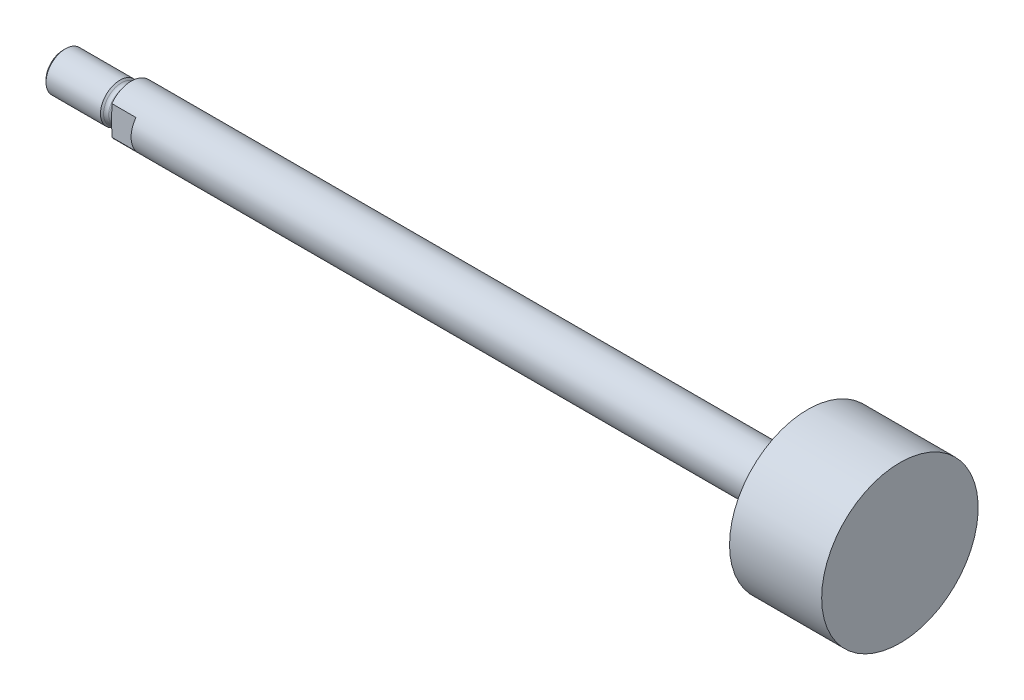
ISO-10303-21;
HEADER;
FILE_DESCRIPTION(('STEP AP214'),'2;1');
FILE_NAME('part.step','',(''),(''),'','','');
FILE_SCHEMA(('AUTOMOTIVE_DESIGN { 1 0 10303 214 1 1 1 1 }'));
ENDSEC;
DATA;
#1=APPLICATION_CONTEXT('core data for automotive mechanical design processes');
#2=APPLICATION_PROTOCOL_DEFINITION('international standard','automotive_design',2000,#1);
#3=PRODUCT_CONTEXT('',#1,'mechanical');
#4=PRODUCT('Part','Part','',(#3));
#5=PRODUCT_RELATED_PRODUCT_CATEGORY('part','',(#4));
#6=PRODUCT_DEFINITION_FORMATION('','',#4);
#7=PRODUCT_DEFINITION_CONTEXT('part definition',#1,'design');
#8=PRODUCT_DEFINITION('design','',#6,#7);
#9=PRODUCT_DEFINITION_SHAPE('','',#8);
#10=(LENGTH_UNIT() NAMED_UNIT(*) SI_UNIT(.MILLI.,.METRE.));
#11=(NAMED_UNIT(*) PLANE_ANGLE_UNIT() SI_UNIT($,.RADIAN.));
#12=(NAMED_UNIT(*) SI_UNIT($,.STERADIAN.) SOLID_ANGLE_UNIT());
#13=UNCERTAINTY_MEASURE_WITH_UNIT(LENGTH_MEASURE(1.E-05),#10,'distance_accuracy_value','');
#14=(GEOMETRIC_REPRESENTATION_CONTEXT(3) GLOBAL_UNCERTAINTY_ASSIGNED_CONTEXT((#13)) GLOBAL_UNIT_ASSIGNED_CONTEXT((#10,
#11,#12)) REPRESENTATION_CONTEXT('',''));
#15=CARTESIAN_POINT('',(0.,0.,0.));
#16=DIRECTION('',(0.,0.,1.));
#17=DIRECTION('',(1.,0.,0.));
#18=AXIS2_PLACEMENT_3D('',#15,#16,#17);
#19=CARTESIAN_POINT('',(-31.75,0.,0.));
#20=DIRECTION('',(1.,0.,0.));
#21=DIRECTION('',(0.,0.,-1.));
#22=AXIS2_PLACEMENT_3D('',#19,#20,#21);
#23=PLANE('',#22);
#24=CARTESIAN_POINT('',(-31.7499999999882,0.,0.));
#25=DIRECTION('',(1.,0.,0.));
#26=DIRECTION('',(0.,1.,0.));
#27=AXIS2_PLACEMENT_3D('',#24,#25,#26);
#28=CIRCLE('',#27,5.59435000002395);
#29=CARTESIAN_POINT('',(-31.7499999999882,5.59435000002395,0.));
#30=VERTEX_POINT('',#29);
#31=EDGE_CURVE('E19',#30,#30,#28,.T.);
#32=ORIENTED_EDGE('',*,*,#31,.F.);
#33=EDGE_LOOP('',(#32));
#34=FACE_BOUND('',#33,.T.);
#35=ADVANCED_FACE('F16',(#34),#23,.F.);
#36=CARTESIAN_POINT('',(-30.9943500001282,0.,0.));
#37=DIRECTION('',(1.,0.,0.));
#38=DIRECTION('',(0.,1.,0.));
#39=AXIS2_PLACEMENT_3D('',#36,#37,#38);
#40=CONICAL_SURFACE('',#39,6.34999999988395,0.785398163397448);
#41=ORIENTED_EDGE('',*,*,#31,.T.);
#42=EDGE_LOOP('',(#41));
#43=FACE_BOUND('',#42,.T.);
#44=CARTESIAN_POINT('',(-30.99435,0.,0.));
#45=DIRECTION('',(-1.,0.,0.));
#46=DIRECTION('',(0.,0.,1.));
#47=AXIS2_PLACEMENT_3D('',#44,#45,#46);
#48=CIRCLE('',#47,6.35);
#49=CARTESIAN_POINT('',(-30.99435,0.,6.35));
#50=VERTEX_POINT('',#49);
#51=EDGE_CURVE('E178',#50,#50,#48,.F.);
#52=ORIENTED_EDGE('',*,*,#51,.F.);
#53=EDGE_LOOP('',(#52));
#54=FACE_BOUND('',#53,.T.);
#55=ADVANCED_FACE('F210',(#43,#54),#40,.T.);
#56=CARTESIAN_POINT('',(-9.525,0.,0.));
#57=DIRECTION('',(-1.,0.,0.));
#58=DIRECTION('',(0.,0.,1.));
#59=AXIS2_PLACEMENT_3D('',#56,#57,#58);
#60=CYLINDRICAL_SURFACE('',#59,6.35);
#61=ORIENTED_EDGE('',*,*,#51,.T.);
#62=EDGE_LOOP('',(#61));
#63=FACE_BOUND('',#62,.T.);
#64=CARTESIAN_POINT('',(-13.2333999999901,0.,0.));
#65=DIRECTION('',(-1.,0.,0.));
#66=DIRECTION('',(0.,0.,1.));
#67=AXIS2_PLACEMENT_3D('',#64,#65,#66);
#68=CIRCLE('',#67,6.34999999999764);
#69=CARTESIAN_POINT('',(-13.2333999999901,0.,6.34999999999764));
#70=VERTEX_POINT('',#69);
#71=EDGE_CURVE('E181',#70,#70,#68,.F.);
#72=ORIENTED_EDGE('',*,*,#71,.F.);
#73=EDGE_LOOP('',(#72));
#74=FACE_BOUND('',#73,.T.);
#75=ADVANCED_FACE('F207',(#63,#74),#60,.T.);
#76=CARTESIAN_POINT('',(-13.2333999998764,0.,0.));
#77=DIRECTION('',(-1.,0.,0.));
#78=DIRECTION('',(0.,0.,1.));
#79=AXIS2_PLACEMENT_3D('',#76,#77,#78);
#80=CONICAL_SURFACE('',#79,6.34999999994079,0.785398163453503);
#81=ORIENTED_EDGE('',*,*,#71,.T.);
#82=EDGE_LOOP('',(#81));
#83=FACE_BOUND('',#82,.T.);
#84=CARTESIAN_POINT('',(-12.726366704261,0.,0.));
#85=DIRECTION('',(1.,0.,0.));
#86=DIRECTION('',(0.,0.,-1.));
#87=AXIS2_PLACEMENT_3D('',#84,#85,#86);
#88=CIRCLE('',#87,5.84296670426099);
#89=CARTESIAN_POINT('',(-12.726366704261,0.,-5.84296670426099));
#90=VERTEX_POINT('',#89);
#91=EDGE_CURVE('E186',#90,#90,#88,.F.);
#92=ORIENTED_EDGE('',*,*,#91,.T.);
#93=EDGE_LOOP('',(#92));
#94=FACE_BOUND('',#93,.T.);
#95=ADVANCED_FACE('F202',(#83,#94),#80,.T.);
#96=CARTESIAN_POINT('',(-11.558933408522,0.,0.));
#97=DIRECTION('',(1.,0.,0.));
#98=DIRECTION('',(0.,0.,-1.));
#99=AXIS2_PLACEMENT_3D('',#96,#97,#98);
#100=TOROIDAL_SURFACE('',#99,7.0104,1.65100000000001);
#101=ORIENTED_EDGE('',*,*,#91,.F.);
#102=EDGE_LOOP('',(#101));
#103=FACE_BOUND('',#102,.T.);
#104=CARTESIAN_POINT('',(-11.558933408522,0.,0.));
#105=DIRECTION('',(-1.,0.,0.));
#106=DIRECTION('',(0.,0.,1.));
#107=AXIS2_PLACEMENT_3D('',#104,#105,#106);
#108=CIRCLE('',#107,5.3594);
#109=CARTESIAN_POINT('',(-11.558933408522,0.,5.3594));
#110=VERTEX_POINT('',#109);
#111=EDGE_CURVE('E191',#110,#110,#108,.F.);
#112=ORIENTED_EDGE('',*,*,#111,.F.);
#113=EDGE_LOOP('',(#112));
#114=FACE_BOUND('',#113,.T.);
#115=ADVANCED_FACE('F197',(#103,#114),#100,.F.);
#116=CARTESIAN_POINT('',(241.173,25.52065,0.));
#117=DIRECTION('',(-1.,0.,0.));
#118=DIRECTION('',(0.,0.,1.));
#119=AXIS2_PLACEMENT_3D('',#116,#117,#118);
#120=PLANE('',#119);
#121=CARTESIAN_POINT('',(241.173,0.,0.));
#122=DIRECTION('',(-1.,0.,0.));
#123=DIRECTION('',(0.,0.,1.));
#124=AXIS2_PLACEMENT_3D('',#121,#122,#123);
#125=CIRCLE('',#124,25.52065);
#126=CARTESIAN_POINT('',(241.173,0.,25.52065));
#127=VERTEX_POINT('',#126);
#128=EDGE_CURVE('E386',#127,#127,#125,.T.);
#129=ORIENTED_EDGE('',*,*,#128,.F.);
#130=EDGE_LOOP('',(#129));
#131=FACE_BOUND('',#130,.T.);
#132=ADVANCED_FACE('F201',(#131),#120,.F.);
#133=CARTESIAN_POINT('',(-9.525,0.,0.));
#134=DIRECTION('',(-1.,0.,0.));
#135=DIRECTION('',(0.,0.,1.));
#136=AXIS2_PLACEMENT_3D('',#133,#134,#135);
#137=CYLINDRICAL_SURFACE('',#136,5.3594);
#138=ORIENTED_EDGE('',*,*,#111,.T.);
#139=EDGE_LOOP('',(#138));
#140=FACE_BOUND('',#139,.T.);
#141=CARTESIAN_POINT('',(-11.176,0.,0.));
#142=DIRECTION('',(1.,0.,0.));
#143=DIRECTION('',(0.,0.,-1.));
#144=AXIS2_PLACEMENT_3D('',#141,#142,#143);
#145=CIRCLE('',#144,5.3594);
#146=CARTESIAN_POINT('',(-11.176,0.,-5.3594));
#147=VERTEX_POINT('',#146);
#148=EDGE_CURVE('E388',#147,#147,#145,.F.);
#149=ORIENTED_EDGE('',*,*,#148,.T.);
#150=EDGE_LOOP('',(#149));
#151=FACE_BOUND('',#150,.T.);
#152=ADVANCED_FACE('F276',(#140,#151),#137,.T.);
#153=CARTESIAN_POINT('',(241.173,0.,0.));
#154=DIRECTION('',(-1.,0.,0.));
#155=DIRECTION('',(0.,0.,1.));
#156=AXIS2_PLACEMENT_3D('',#153,#154,#155);
#157=CYLINDRICAL_SURFACE('',#156,25.52065);
#158=CARTESIAN_POINT('',(211.1248,0.,0.));
#159=DIRECTION('',(-1.,0.,0.));
#160=DIRECTION('',(0.,0.,1.));
#161=AXIS2_PLACEMENT_3D('',#158,#159,#160);
#162=CIRCLE('',#161,25.52065);
#163=CARTESIAN_POINT('',(211.1248,0.,25.52065));
#164=VERTEX_POINT('',#163);
#165=EDGE_CURVE('E90',#164,#164,#162,.F.);
#166=ORIENTED_EDGE('',*,*,#165,.T.);
#167=EDGE_LOOP('',(#166));
#168=FACE_BOUND('',#167,.T.);
#169=ORIENTED_EDGE('',*,*,#128,.T.);
#170=EDGE_LOOP('',(#169));
#171=FACE_BOUND('',#170,.T.);
#172=ADVANCED_FACE('F269',(#168,#171),#157,.T.);
#173=CARTESIAN_POINT('',(-11.176,0.,0.));
#174=DIRECTION('',(1.,0.,0.));
#175=DIRECTION('',(0.,0.,-1.));
#176=AXIS2_PLACEMENT_3D('',#173,#174,#175);
#177=TOROIDAL_SURFACE('',#176,7.0104,1.651);
#178=ORIENTED_EDGE('',*,*,#148,.F.);
#179=EDGE_LOOP('',(#178));
#180=FACE_BOUND('',#179,.T.);
#181=CARTESIAN_POINT('',(-9.525,2.97038855370801,-6.35));
#182=CARTESIAN_POINT('',(-9.52500432717314,2.87856001304067,-6.35));
#183=CARTESIAN_POINT('',(-9.52637466481895,2.78674691580267,-6.35));
#184=CARTESIAN_POINT('',(-9.53125694264594,2.60320136632233,-6.35));
#185=CARTESIAN_POINT('',(-9.53476827720515,2.51146889861821,-6.35));
#186=CARTESIAN_POINT('',(-9.54764417214961,2.23608737385469,-6.35));
#187=CARTESIAN_POINT('',(-9.55934673670103,2.05255650770518,-6.35));
#188=CARTESIAN_POINT('',(-9.5846169660275,1.68545441374015,-6.35));
#189=CARTESIAN_POINT('',(-9.59818655095662,1.50188334117978,-6.35));
#190=CARTESIAN_POINT('',(-9.62318520155134,1.13501829903267,-6.35));
#191=CARTESIAN_POINT('',(-9.63461933357041,0.951724723885822,-6.35));
#192=CARTESIAN_POINT('',(-9.64786787115241,0.676684464035815,-6.35));
#193=CARTESIAN_POINT('',(-9.65163267642366,0.585034676844251,-6.35));
#194=CARTESIAN_POINT('',(-9.65761687588684,0.401685560228313,-6.35));
#195=CARTESIAN_POINT('',(-9.65983630232245,0.309986231877548,-6.35));
#196=CARTESIAN_POINT('',(-9.66256716675136,0.12663024456845,-6.35));
#197=CARTESIAN_POINT('',(-9.66307988474391,0.0349736052032149,-6.35));
#198=CARTESIAN_POINT('',(-9.66236638328493,-0.148332071725467,-6.35));
#199=CARTESIAN_POINT('',(-9.66114017346013,-0.239981109328187,-6.35000000000001));
#200=CARTESIAN_POINT('',(-9.65662353619468,-0.441500345888313,-6.35000000000002));
#201=CARTESIAN_POINT('',(-9.65297047367083,-0.551362349619012,-6.35));
#202=CARTESIAN_POINT('',(-9.64364720433923,-0.771058786420898,-6.35));
#203=CARTESIAN_POINT('',(-9.63797587423027,-0.88089316998469,-6.35));
#204=CARTESIAN_POINT('',(-9.62518265463312,-1.10053620189394,-6.35));
#205=CARTESIAN_POINT('',(-9.61805995669679,-1.2103448015983,-6.35));
#206=CARTESIAN_POINT('',(-9.60308054190903,-1.42994756441094,-6.35));
#207=CARTESIAN_POINT('',(-9.59522357647099,-1.53974170993603,-6.35));
#208=CARTESIAN_POINT('',(-9.57958178368191,-1.75953919720968,-6.35));
#209=CARTESIAN_POINT('',(-9.57179711614879,-1.86954255122618,-6.35));
#210=CARTESIAN_POINT('',(-9.55720939085882,-2.08957585527725,-6.35));
#211=CARTESIAN_POINT('',(-9.55040597696202,-2.19960578107058,-6.35));
#212=CARTESIAN_POINT('',(-9.53871837056633,-2.41972206498445,-6.35));
#213=CARTESIAN_POINT('',(-9.53383322860493,-2.52980836811447,-6.35));
#214=CARTESIAN_POINT('',(-9.52697965054751,-2.75004901434376,-6.35));
#215=CARTESIAN_POINT('',(-9.52501073020114,-2.86020334310726,-6.35));
#216=CARTESIAN_POINT('',(-9.525,-2.97038855370809,-6.35));
#217=B_SPLINE_CURVE_WITH_KNOTS('',3,(#181,#182,#183,#184,#185,#186,#187,#188,#189,#190,#191,
#192,#193,#194,#195,#196,#197,#198,#199,#200,#201,#202,#203,#204,#205,#206,#207,#208,#209,#210,
#211,#212,#213,#214,#215,#216),.UNSPECIFIED.,.F.,.F.,(4,2,2,2,2,2,2,2,2,2,2,2,2,2,2,2,2,4),(0.,
0.275453824117417,0.550829766971975,1.10248801480419,1.65471792159181,2.20562054264102,
2.48079023089343,2.75595417767494,3.03091171012026,3.30586772040328,3.63561237057661,
3.96554083351519,4.29565357971293,4.62587849341643,4.95671259976355,5.28742632811416,
5.61797616036996,5.94847109733863),.UNSPECIFIED.);
#218=CARTESIAN_POINT('',(-9.52499999999963,2.97038855370801,-6.35));
#219=VERTEX_POINT('',#218);
#220=CARTESIAN_POINT('',(-9.525,-2.97038855370809,-6.34999999999999));
#221=VERTEX_POINT('',#220);
#222=EDGE_CURVE('E65',#219,#221,#217,.T.);
#223=ORIENTED_EDGE('',*,*,#222,.T.);
#224=CARTESIAN_POINT('',(-9.525,0.,0.));
#225=DIRECTION('',(-1.,0.,0.));
#226=DIRECTION('',(0.,-0.423711707421558,-0.905797101449275));
#227=AXIS2_PLACEMENT_3D('',#224,#225,#226);
#228=CIRCLE('',#227,7.01039999999997);
#229=CARTESIAN_POINT('',(-9.52499999999982,-2.97038855370801,6.35));
#230=VERTEX_POINT('',#229);
#231=EDGE_CURVE('E78',#221,#230,#228,.T.);
#232=ORIENTED_EDGE('',*,*,#231,.T.);
#233=CARTESIAN_POINT('',(-9.525,-2.97038855370801,6.35));
#234=CARTESIAN_POINT('',(-9.52500432717314,-2.87856001304066,6.35));
#235=CARTESIAN_POINT('',(-9.52637466481895,-2.78674691580267,6.35));
#236=CARTESIAN_POINT('',(-9.53125694264594,-2.60320136632233,6.35));
#237=CARTESIAN_POINT('',(-9.53476827720515,-2.5114688986182,6.35));
#238=CARTESIAN_POINT('',(-9.54764417214961,-2.23608737385469,6.35));
#239=CARTESIAN_POINT('',(-9.55934673670103,-2.05255650770518,6.35));
#240=CARTESIAN_POINT('',(-9.5846169660275,-1.68545441374014,6.35));
#241=CARTESIAN_POINT('',(-9.59818655095662,-1.50188334117978,6.35));
#242=CARTESIAN_POINT('',(-9.62318520155134,-1.13501829903267,6.35));
#243=CARTESIAN_POINT('',(-9.63461933357041,-0.951724723885818,6.35));
#244=CARTESIAN_POINT('',(-9.64786787115241,-0.676684464035811,6.35));
#245=CARTESIAN_POINT('',(-9.65163267642366,-0.585034676844247,6.35));
#246=CARTESIAN_POINT('',(-9.65761687588684,-0.401685560228309,6.35));
#247=CARTESIAN_POINT('',(-9.65983630232245,-0.309986231877544,6.35));
#248=CARTESIAN_POINT('',(-9.66256716675136,-0.126630244568446,6.35));
#249=CARTESIAN_POINT('',(-9.66307988474391,-0.0349736052032102,6.35));
#250=CARTESIAN_POINT('',(-9.66236638328493,0.148332071725471,6.35));
#251=CARTESIAN_POINT('',(-9.66114017346013,0.239981109328192,6.35000000000002));
#252=CARTESIAN_POINT('',(-9.65662353619468,0.441500345888318,6.35000000000002));
#253=CARTESIAN_POINT('',(-9.65297047367083,0.551362349619017,6.35));
#254=CARTESIAN_POINT('',(-9.64364720433923,0.771058786420902,6.34999999999999));
#255=CARTESIAN_POINT('',(-9.63797587423028,0.880893169984694,6.35));
#256=CARTESIAN_POINT('',(-9.62518265463312,1.10053620189394,6.35));
#257=CARTESIAN_POINT('',(-9.61805995669679,1.2103448015983,6.35));
#258=CARTESIAN_POINT('',(-9.60308054190903,1.42994756441094,6.35));
#259=CARTESIAN_POINT('',(-9.595223576471,1.53974170993603,6.35));
#260=CARTESIAN_POINT('',(-9.57958178368191,1.75953919720968,6.35));
#261=CARTESIAN_POINT('',(-9.57179711614879,1.86954255122618,6.35));
#262=CARTESIAN_POINT('',(-9.55720939085882,2.08957585527725,6.35));
#263=CARTESIAN_POINT('',(-9.55040597696202,2.19960578107058,6.35));
#264=CARTESIAN_POINT('',(-9.53871837056633,2.41972206498445,6.35));
#265=CARTESIAN_POINT('',(-9.53383322860493,2.52980836811447,6.35));
#266=CARTESIAN_POINT('',(-9.52697965054751,2.75004901434376,6.35));
#267=CARTESIAN_POINT('',(-9.52501073020114,2.86020334310726,6.35));
#268=CARTESIAN_POINT('',(-9.525,2.97038855370809,6.35));
#269=B_SPLINE_CURVE_WITH_KNOTS('',3,(#233,#234,#235,#236,#237,#238,#239,#240,#241,#242,#243,
#244,#245,#246,#247,#248,#249,#250,#251,#252,#253,#254,#255,#256,#257,#258,#259,#260,#261,#262,
#263,#264,#265,#266,#267,#268),.UNSPECIFIED.,.F.,.F.,(4,2,2,2,2,2,2,2,2,2,2,2,2,2,2,2,2,4),(0.,
0.275453824117417,0.550829766971975,1.10248801480419,1.65471792159181,2.20562054264102,
2.48079023089344,2.75595417767494,3.03091171012026,3.30586772040329,3.63561237057661,
3.96554083351519,4.29565357971293,4.62587849341643,4.95671259976355,5.28742632811416,
5.61797616036996,5.94847109733862),.UNSPECIFIED.);
#270=CARTESIAN_POINT('',(-9.525,2.97038855370809,6.34999999999999));
#271=VERTEX_POINT('',#270);
#272=EDGE_CURVE('E73',#230,#271,#269,.T.);
#273=ORIENTED_EDGE('',*,*,#272,.T.);
#274=CARTESIAN_POINT('',(-9.525,0.,0.));
#275=DIRECTION('',(-1.,0.,0.));
#276=DIRECTION('',(0.,0.423711707421558,0.905797101449275));
#277=AXIS2_PLACEMENT_3D('',#274,#275,#276);
#278=CIRCLE('',#277,7.01039999999997);
#279=EDGE_CURVE('E76',#271,#219,#278,.T.);
#280=ORIENTED_EDGE('',*,*,#279,.T.);
#281=EDGE_LOOP('',(#223,#232,#273,#280));
#282=FACE_BOUND('',#281,.T.);
#283=ADVANCED_FACE('F75',(#180,#282),#177,.F.);
#284=CARTESIAN_POINT('',(211.1248,7.9375,0.));
#285=DIRECTION('',(1.,0.,0.));
#286=DIRECTION('',(0.,0.,-1.));
#287=AXIS2_PLACEMENT_3D('',#284,#285,#286);
#288=PLANE('',#287);
#289=CARTESIAN_POINT('',(211.1248,0.,0.));
#290=DIRECTION('',(-1.,0.,0.));
#291=DIRECTION('',(0.,0.,1.));
#292=AXIS2_PLACEMENT_3D('',#289,#290,#291);
#293=CIRCLE('',#292,7.9375);
#294=CARTESIAN_POINT('',(211.1248,0.,7.9375));
#295=VERTEX_POINT('',#294);
#296=EDGE_CURVE('E109',#295,#295,#293,.T.);
#297=ORIENTED_EDGE('',*,*,#296,.F.);
#298=EDGE_LOOP('',(#297));
#299=FACE_BOUND('',#298,.T.);
#300=ORIENTED_EDGE('',*,*,#165,.F.);
#301=EDGE_LOOP('',(#300));
#302=FACE_BOUND('',#301,.T.);
#303=ADVANCED_FACE('F256',(#299,#302),#288,.F.);
#304=CARTESIAN_POINT('',(-9.525,0.,0.));
#305=DIRECTION('',(1.,0.,0.));
#306=DIRECTION('',(0.,0.,-1.));
#307=AXIS2_PLACEMENT_3D('',#304,#305,#306);
#308=PLANE('',#307);
#309=DIRECTION('',(0.,1.,0.));
#310=VECTOR('',#309,1.);
#311=CARTESIAN_POINT('',(-9.525,7.9375,6.35));
#312=LINE('',#311,#310);
#313=CARTESIAN_POINT('',(-9.525,4.7625,6.35));
#314=VERTEX_POINT('',#313);
#315=EDGE_CURVE('E83',#271,#314,#312,.T.);
#316=ORIENTED_EDGE('',*,*,#315,.T.);
#317=CARTESIAN_POINT('',(-9.52500000000001,0.,0.));
#318=DIRECTION('',(-1.,0.,0.));
#319=DIRECTION('',(0.,0.,1.));
#320=AXIS2_PLACEMENT_3D('',#317,#318,#319);
#321=CIRCLE('',#320,7.9375);
#322=CARTESIAN_POINT('',(-9.525,4.7625,-6.35));
#323=VERTEX_POINT('',#322);
#324=EDGE_CURVE('E56',#323,#314,#321,.F.);
#325=ORIENTED_EDGE('',*,*,#324,.F.);
#326=DIRECTION('',(0.,1.,0.));
#327=VECTOR('',#326,1.);
#328=CARTESIAN_POINT('',(-9.525,-7.9375,-6.35));
#329=LINE('',#328,#327);
#330=EDGE_CURVE('E89',#323,#219,#329,.F.);
#331=ORIENTED_EDGE('',*,*,#330,.T.);
#332=ORIENTED_EDGE('',*,*,#279,.F.);
#333=EDGE_LOOP('',(#316,#325,#331,#332));
#334=FACE_BOUND('',#333,.T.);
#335=ADVANCED_FACE('F87',(#334),#308,.F.);
#336=CARTESIAN_POINT('',(-1.651,0.,0.));
#337=DIRECTION('',(1.,0.,0.));
#338=DIRECTION('',(0.,0.,-1.));
#339=AXIS2_PLACEMENT_3D('',#336,#337,#338);
#340=PLANE('',#339);
#341=CARTESIAN_POINT('',(-1.65100000000001,0.,0.));
#342=DIRECTION('',(-1.,0.,0.));
#343=DIRECTION('',(0.,0.,1.));
#344=AXIS2_PLACEMENT_3D('',#341,#342,#343);
#345=CIRCLE('',#344,7.9375);
#346=CARTESIAN_POINT('',(-1.65100000000001,4.7625,6.35));
#347=VERTEX_POINT('',#346);
#348=CARTESIAN_POINT('',(-1.65100000000001,-4.7625,6.35));
#349=VERTEX_POINT('',#348);
#350=EDGE_CURVE('E105',#347,#349,#345,.F.);
#351=ORIENTED_EDGE('',*,*,#350,.F.);
#352=DIRECTION('',(0.,1.,0.));
#353=VECTOR('',#352,1.);
#354=CARTESIAN_POINT('',(-1.65100000000001,7.9375,6.35));
#355=LINE('',#354,#353);
#356=EDGE_CURVE('E84',#347,#349,#355,.F.);
#357=ORIENTED_EDGE('',*,*,#356,.T.);
#358=EDGE_LOOP('',(#351,#357));
#359=FACE_BOUND('',#358,.T.);
#360=ADVANCED_FACE('F244',(#359),#340,.F.);
#361=CARTESIAN_POINT('',(-1.651,7.9375,6.35));
#362=DIRECTION('',(0.,0.,-1.));
#363=DIRECTION('',(-1.,0.,0.));
#364=AXIS2_PLACEMENT_3D('',#361,#362,#363);
#365=PLANE('',#364);
#366=ORIENTED_EDGE('',*,*,#272,.F.);
#367=DIRECTION('',(0.,1.,0.));
#368=VECTOR('',#367,1.);
#369=CARTESIAN_POINT('',(-9.525,0.,6.35));
#370=LINE('',#369,#368);
#371=CARTESIAN_POINT('',(-9.525,-4.7625,6.35));
#372=VERTEX_POINT('',#371);
#373=EDGE_CURVE('E96',#230,#372,#370,.F.);
#374=ORIENTED_EDGE('',*,*,#373,.T.);
#375=DIRECTION('',(-1.,0.,0.));
#376=VECTOR('',#375,1.);
#377=CARTESIAN_POINT('',(241.173,-4.7625,6.35));
#378=LINE('',#377,#376);
#379=EDGE_CURVE('E101',#349,#372,#378,.T.);
#380=ORIENTED_EDGE('',*,*,#379,.F.);
#381=ORIENTED_EDGE('',*,*,#356,.F.);
#382=DIRECTION('',(-1.,0.,0.));
#383=VECTOR('',#382,1.);
#384=CARTESIAN_POINT('',(241.173,4.7625,6.35));
#385=LINE('',#384,#383);
#386=EDGE_CURVE('E95',#314,#347,#385,.F.);
#387=ORIENTED_EDGE('',*,*,#386,.F.);
#388=ORIENTED_EDGE('',*,*,#315,.F.);
#389=EDGE_LOOP('',(#366,#374,#380,#381,#387,#388));
#390=FACE_BOUND('',#389,.T.);
#391=ADVANCED_FACE('F93',(#390),#365,.F.);
#392=CARTESIAN_POINT('',(-9.525,0.,0.));
#393=DIRECTION('',(1.,0.,0.));
#394=DIRECTION('',(0.,0.,-1.));
#395=AXIS2_PLACEMENT_3D('',#392,#393,#394);
#396=PLANE('',#395);
#397=DIRECTION('',(0.,1.,0.));
#398=VECTOR('',#397,1.);
#399=CARTESIAN_POINT('',(-9.525,-7.9375,-6.35));
#400=LINE('',#399,#398);
#401=CARTESIAN_POINT('',(-9.525,-4.7625,-6.35));
#402=VERTEX_POINT('',#401);
#403=EDGE_CURVE('E112',#221,#402,#400,.F.);
#404=ORIENTED_EDGE('',*,*,#403,.T.);
#405=CARTESIAN_POINT('',(-9.52500000000001,0.,0.));
#406=DIRECTION('',(-1.,0.,0.));
#407=DIRECTION('',(0.,0.,1.));
#408=AXIS2_PLACEMENT_3D('',#405,#406,#407);
#409=CIRCLE('',#408,7.9375);
#410=EDGE_CURVE('E161',#372,#402,#409,.F.);
#411=ORIENTED_EDGE('',*,*,#410,.F.);
#412=ORIENTED_EDGE('',*,*,#373,.F.);
#413=ORIENTED_EDGE('',*,*,#231,.F.);
#414=EDGE_LOOP('',(#404,#411,#412,#413));
#415=FACE_BOUND('',#414,.T.);
#416=ADVANCED_FACE('F138',(#415),#396,.F.);
#417=CARTESIAN_POINT('',(-1.651,0.,0.));
#418=DIRECTION('',(1.,0.,0.));
#419=DIRECTION('',(0.,0.,-1.));
#420=AXIS2_PLACEMENT_3D('',#417,#418,#419);
#421=PLANE('',#420);
#422=CARTESIAN_POINT('',(-1.65100000000001,0.,0.));
#423=DIRECTION('',(-1.,0.,0.));
#424=DIRECTION('',(0.,0.,1.));
#425=AXIS2_PLACEMENT_3D('',#422,#423,#424);
#426=CIRCLE('',#425,7.9375);
#427=CARTESIAN_POINT('',(-1.65100000000001,-4.7625,-6.35));
#428=VERTEX_POINT('',#427);
#429=CARTESIAN_POINT('',(-1.65100000000001,4.7625,-6.35));
#430=VERTEX_POINT('',#429);
#431=EDGE_CURVE('E25',#428,#430,#426,.F.);
#432=ORIENTED_EDGE('',*,*,#431,.F.);
#433=DIRECTION('',(0.,1.,0.));
#434=VECTOR('',#433,1.);
#435=CARTESIAN_POINT('',(-1.65100000000001,-7.9375,-6.35));
#436=LINE('',#435,#434);
#437=EDGE_CURVE('E33',#428,#430,#436,.T.);
#438=ORIENTED_EDGE('',*,*,#437,.T.);
#439=EDGE_LOOP('',(#432,#438));
#440=FACE_BOUND('',#439,.T.);
#441=ADVANCED_FACE('F134',(#440),#421,.F.);
#442=CARTESIAN_POINT('',(-1.651,-7.9375,-6.35));
#443=DIRECTION('',(0.,0.,1.));
#444=DIRECTION('',(1.,0.,0.));
#445=AXIS2_PLACEMENT_3D('',#442,#443,#444);
#446=PLANE('',#445);
#447=ORIENTED_EDGE('',*,*,#222,.F.);
#448=ORIENTED_EDGE('',*,*,#330,.F.);
#449=DIRECTION('',(-1.,0.,0.));
#450=VECTOR('',#449,1.);
#451=CARTESIAN_POINT('',(241.173,4.7625,-6.35));
#452=LINE('',#451,#450);
#453=EDGE_CURVE('E10',#430,#323,#452,.T.);
#454=ORIENTED_EDGE('',*,*,#453,.F.);
#455=ORIENTED_EDGE('',*,*,#437,.F.);
#456=DIRECTION('',(-1.,0.,0.));
#457=VECTOR('',#456,1.);
#458=CARTESIAN_POINT('',(241.173,-4.7625,-6.35));
#459=LINE('',#458,#457);
#460=EDGE_CURVE('E158',#402,#428,#459,.F.);
#461=ORIENTED_EDGE('',*,*,#460,.F.);
#462=ORIENTED_EDGE('',*,*,#403,.F.);
#463=EDGE_LOOP('',(#447,#448,#454,#455,#461,#462));
#464=FACE_BOUND('',#463,.T.);
#465=ADVANCED_FACE('F128',(#464),#446,.F.);
#466=CARTESIAN_POINT('',(241.173,0.,0.));
#467=DIRECTION('',(-1.,0.,0.));
#468=DIRECTION('',(0.,0.,1.));
#469=AXIS2_PLACEMENT_3D('',#466,#467,#468);
#470=CYLINDRICAL_SURFACE('',#469,7.9375);
#471=ORIENTED_EDGE('',*,*,#431,.T.);
#472=ORIENTED_EDGE('',*,*,#453,.T.);
#473=ORIENTED_EDGE('',*,*,#324,.T.);
#474=ORIENTED_EDGE('',*,*,#386,.T.);
#475=ORIENTED_EDGE('',*,*,#350,.T.);
#476=ORIENTED_EDGE('',*,*,#379,.T.);
#477=ORIENTED_EDGE('',*,*,#410,.T.);
#478=ORIENTED_EDGE('',*,*,#460,.T.);
#479=EDGE_LOOP('',(#471,#472,#473,#474,#475,#476,#477,#478));
#480=FACE_BOUND('',#479,.T.);
#481=ORIENTED_EDGE('',*,*,#296,.T.);
#482=EDGE_LOOP('',(#481));
#483=FACE_BOUND('',#482,.T.);
#484=ADVANCED_FACE('F133',(#480,#483),#470,.T.);
#485=CLOSED_SHELL('',(#35,#55,#75,#95,#115,#132,#152,#172,#283,#303,#335,#360,#391,#416,#441,
#465,#484));
#486=MANIFOLD_SOLID_BREP('B1',#485);
#487=ADVANCED_BREP_SHAPE_REPRESENTATION('',(#18,#486),#14);
#488=SHAPE_DEFINITION_REPRESENTATION(#9,#487);
ENDSEC;
END-ISO-10303-21;
